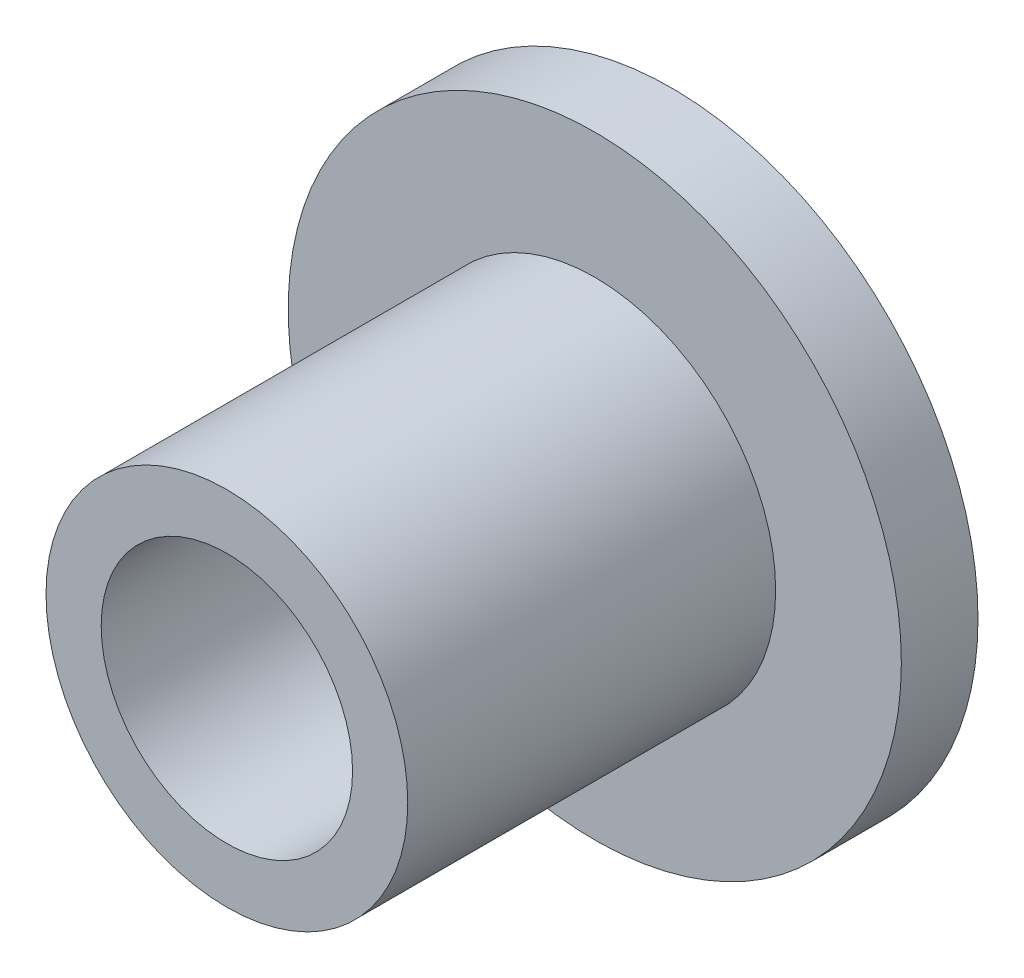
ISO-10303-21;
HEADER;
FILE_DESCRIPTION(('STEP AP214'),'2;1');
FILE_NAME('part.step','',(''),(''),'','','');
FILE_SCHEMA(('AUTOMOTIVE_DESIGN { 1 0 10303 214 1 1 1 1 }'));
ENDSEC;
DATA;
#1=APPLICATION_CONTEXT('core data for automotive mechanical design processes');
#2=APPLICATION_PROTOCOL_DEFINITION('international standard','automotive_design',2000,#1);
#3=PRODUCT_CONTEXT('',#1,'mechanical');
#4=PRODUCT('Part','Part','',(#3));
#5=PRODUCT_RELATED_PRODUCT_CATEGORY('part','',(#4));
#6=PRODUCT_DEFINITION_FORMATION('','',#4);
#7=PRODUCT_DEFINITION_CONTEXT('part definition',#1,'design');
#8=PRODUCT_DEFINITION('design','',#6,#7);
#9=PRODUCT_DEFINITION_SHAPE('','',#8);
#10=(LENGTH_UNIT() NAMED_UNIT(*) SI_UNIT(.MILLI.,.METRE.));
#11=(NAMED_UNIT(*) PLANE_ANGLE_UNIT() SI_UNIT($,.RADIAN.));
#12=(NAMED_UNIT(*) SI_UNIT($,.STERADIAN.) SOLID_ANGLE_UNIT());
#13=UNCERTAINTY_MEASURE_WITH_UNIT(LENGTH_MEASURE(1.E-05),#10,'distance_accuracy_value','');
#14=(GEOMETRIC_REPRESENTATION_CONTEXT(3) GLOBAL_UNCERTAINTY_ASSIGNED_CONTEXT((#13)) GLOBAL_UNIT_ASSIGNED_CONTEXT((#10,
#11,#12)) REPRESENTATION_CONTEXT('',''));
#15=CARTESIAN_POINT('',(0.,0.,0.));
#16=DIRECTION('',(0.,0.,1.));
#17=DIRECTION('',(1.,0.,0.));
#18=AXIS2_PLACEMENT_3D('',#15,#16,#17);
#19=CARTESIAN_POINT('',(0.,0.,7.25));
#20=DIRECTION('',(0.,0.,-1.));
#21=DIRECTION('',(-1.,0.,0.));
#22=AXIS2_PLACEMENT_3D('',#19,#20,#21);
#23=CYLINDRICAL_SURFACE('',#22,2.05);
#24=CARTESIAN_POINT('',(0.,0.,7.25));
#25=DIRECTION('',(0.,0.,1.));
#26=DIRECTION('',(1.,0.,0.));
#27=AXIS2_PLACEMENT_3D('',#24,#25,#26);
#28=CIRCLE('',#27,2.05);
#29=CARTESIAN_POINT('',(2.05,0.,7.25));
#30=VERTEX_POINT('',#29);
#31=EDGE_CURVE('E51',#30,#30,#28,.T.);
#32=ORIENTED_EDGE('',*,*,#31,.T.);
#33=EDGE_LOOP('',(#32));
#34=FACE_BOUND('',#33,.T.);
#35=CARTESIAN_POINT('',(0.,0.,0.6));
#36=DIRECTION('',(0.,0.,-1.));
#37=DIRECTION('',(-1.,0.,0.));
#38=AXIS2_PLACEMENT_3D('',#35,#36,#37);
#39=CIRCLE('',#38,2.05);
#40=CARTESIAN_POINT('',(-2.05,0.,0.6));
#41=VERTEX_POINT('',#40);
#42=EDGE_CURVE('E37',#41,#41,#39,.T.);
#43=ORIENTED_EDGE('',*,*,#42,.T.);
#44=EDGE_LOOP('',(#43));
#45=FACE_BOUND('',#44,.T.);
#46=ADVANCED_FACE('F33',(#34,#45),#23,.F.);
#47=CARTESIAN_POINT('',(0.,0.,1.25));
#48=DIRECTION('',(0.,0.,-1.));
#49=DIRECTION('',(-1.,0.,0.));
#50=AXIS2_PLACEMENT_3D('',#47,#48,#49);
#51=CYLINDRICAL_SURFACE('',#50,5.);
#52=CARTESIAN_POINT('',(0.,0.,1.25));
#53=DIRECTION('',(0.,0.,1.));
#54=DIRECTION('',(1.,0.,0.));
#55=AXIS2_PLACEMENT_3D('',#52,#53,#54);
#56=CIRCLE('',#55,5.);
#57=CARTESIAN_POINT('',(5.,0.,1.25));
#58=VERTEX_POINT('',#57);
#59=EDGE_CURVE('E10',#58,#58,#56,.T.);
#60=ORIENTED_EDGE('',*,*,#59,.F.);
#61=EDGE_LOOP('',(#60));
#62=FACE_BOUND('',#61,.T.);
#63=CARTESIAN_POINT('',(0.,0.,0.));
#64=DIRECTION('',(0.,0.,1.));
#65=DIRECTION('',(1.,0.,0.));
#66=AXIS2_PLACEMENT_3D('',#63,#64,#65);
#67=CIRCLE('',#66,5.);
#68=CARTESIAN_POINT('',(5.,0.,0.));
#69=VERTEX_POINT('',#68);
#70=EDGE_CURVE('E41',#69,#69,#67,.T.);
#71=ORIENTED_EDGE('',*,*,#70,.T.);
#72=EDGE_LOOP('',(#71));
#73=FACE_BOUND('',#72,.T.);
#74=ADVANCED_FACE('F35',(#62,#73),#51,.T.);
#75=CARTESIAN_POINT('',(0.,0.,1.25));
#76=DIRECTION('',(0.,0.,1.));
#77=DIRECTION('',(1.,0.,0.));
#78=AXIS2_PLACEMENT_3D('',#75,#76,#77);
#79=PLANE('',#78);
#80=CARTESIAN_POINT('',(0.,0.,1.25));
#81=DIRECTION('',(0.,0.,1.));
#82=DIRECTION('',(1.,0.,0.));
#83=AXIS2_PLACEMENT_3D('',#80,#81,#82);
#84=CIRCLE('',#83,2.95);
#85=CARTESIAN_POINT('',(2.95,0.,1.25));
#86=VERTEX_POINT('',#85);
#87=EDGE_CURVE('E48',#86,#86,#84,.T.);
#88=ORIENTED_EDGE('',*,*,#87,.F.);
#89=EDGE_LOOP('',(#88));
#90=FACE_BOUND('',#89,.T.);
#91=ORIENTED_EDGE('',*,*,#59,.T.);
#92=EDGE_LOOP('',(#91));
#93=FACE_BOUND('',#92,.T.);
#94=ADVANCED_FACE('F83',(#90,#93),#79,.T.);
#95=CARTESIAN_POINT('',(0.,0.,0.));
#96=DIRECTION('',(0.,0.,1.));
#97=DIRECTION('',(1.,0.,0.));
#98=AXIS2_PLACEMENT_3D('',#95,#96,#97);
#99=PLANE('',#98);
#100=CARTESIAN_POINT('',(0.,0.,0.));
#101=DIRECTION('',(0.,0.,-1.));
#102=DIRECTION('',(-1.,0.,0.));
#103=AXIS2_PLACEMENT_3D('',#100,#101,#102);
#104=CIRCLE('',#103,3.05);
#105=CARTESIAN_POINT('',(-3.05,0.,0.));
#106=VERTEX_POINT('',#105);
#107=EDGE_CURVE('E56',#106,#106,#104,.T.);
#108=ORIENTED_EDGE('',*,*,#107,.F.);
#109=EDGE_LOOP('',(#108));
#110=FACE_BOUND('',#109,.T.);
#111=ORIENTED_EDGE('',*,*,#70,.F.);
#112=EDGE_LOOP('',(#111));
#113=FACE_BOUND('',#112,.T.);
#114=ADVANCED_FACE('F89',(#110,#113),#99,.F.);
#115=CARTESIAN_POINT('',(0.,0.,7.25));
#116=DIRECTION('',(0.,0.,1.));
#117=DIRECTION('',(1.,0.,0.));
#118=AXIS2_PLACEMENT_3D('',#115,#116,#117);
#119=PLANE('',#118);
#120=CARTESIAN_POINT('',(0.,0.,7.25));
#121=DIRECTION('',(0.,0.,1.));
#122=DIRECTION('',(1.,0.,0.));
#123=AXIS2_PLACEMENT_3D('',#120,#121,#122);
#124=CIRCLE('',#123,2.95);
#125=CARTESIAN_POINT('',(2.95,0.,7.25));
#126=VERTEX_POINT('',#125);
#127=EDGE_CURVE('E46',#126,#126,#124,.T.);
#128=ORIENTED_EDGE('',*,*,#127,.T.);
#129=EDGE_LOOP('',(#128));
#130=FACE_BOUND('',#129,.T.);
#131=ORIENTED_EDGE('',*,*,#31,.F.);
#132=EDGE_LOOP('',(#131));
#133=FACE_BOUND('',#132,.T.);
#134=ADVANCED_FACE('F86',(#130,#133),#119,.T.);
#135=CARTESIAN_POINT('',(0.,0.,7.25));
#136=DIRECTION('',(0.,0.,-1.));
#137=DIRECTION('',(-1.,0.,0.));
#138=AXIS2_PLACEMENT_3D('',#135,#136,#137);
#139=CYLINDRICAL_SURFACE('',#138,2.95);
#140=ORIENTED_EDGE('',*,*,#127,.F.);
#141=EDGE_LOOP('',(#140));
#142=FACE_BOUND('',#141,.T.);
#143=ORIENTED_EDGE('',*,*,#87,.T.);
#144=EDGE_LOOP('',(#143));
#145=FACE_BOUND('',#144,.T.);
#146=ADVANCED_FACE('F74',(#142,#145),#139,.T.);
#147=CARTESIAN_POINT('',(0.,0.,0.6));
#148=DIRECTION('',(0.,0.,-1.));
#149=DIRECTION('',(-1.,0.,0.));
#150=AXIS2_PLACEMENT_3D('',#147,#148,#149);
#151=CYLINDRICAL_SURFACE('',#150,3.05);
#152=CARTESIAN_POINT('',(0.,0.,0.6));
#153=DIRECTION('',(0.,0.,-1.));
#154=DIRECTION('',(-1.,0.,0.));
#155=AXIS2_PLACEMENT_3D('',#152,#153,#154);
#156=CIRCLE('',#155,3.05);
#157=CARTESIAN_POINT('',(-3.05,0.,0.6));
#158=VERTEX_POINT('',#157);
#159=EDGE_CURVE('E59',#158,#158,#156,.T.);
#160=ORIENTED_EDGE('',*,*,#159,.F.);
#161=EDGE_LOOP('',(#160));
#162=FACE_BOUND('',#161,.T.);
#163=ORIENTED_EDGE('',*,*,#107,.T.);
#164=EDGE_LOOP('',(#163));
#165=FACE_BOUND('',#164,.T.);
#166=ADVANCED_FACE('F69',(#162,#165),#151,.F.);
#167=CARTESIAN_POINT('',(0.,0.,0.6));
#168=DIRECTION('',(0.,0.,-1.));
#169=DIRECTION('',(-1.,0.,0.));
#170=AXIS2_PLACEMENT_3D('',#167,#168,#169);
#171=PLANE('',#170);
#172=ORIENTED_EDGE('',*,*,#42,.F.);
#173=EDGE_LOOP('',(#172));
#174=FACE_BOUND('',#173,.T.);
#175=ORIENTED_EDGE('',*,*,#159,.T.);
#176=EDGE_LOOP('',(#175));
#177=FACE_BOUND('',#176,.T.);
#178=ADVANCED_FACE('F67',(#174,#177),#171,.T.);
#179=CLOSED_SHELL('',(#46,#74,#94,#114,#134,#146,#166,#178));
#180=MANIFOLD_SOLID_BREP('B2',#179);
#181=ADVANCED_BREP_SHAPE_REPRESENTATION('',(#18,#180),#14);
#182=SHAPE_DEFINITION_REPRESENTATION(#9,#181);
ENDSEC;
END-ISO-10303-21;
